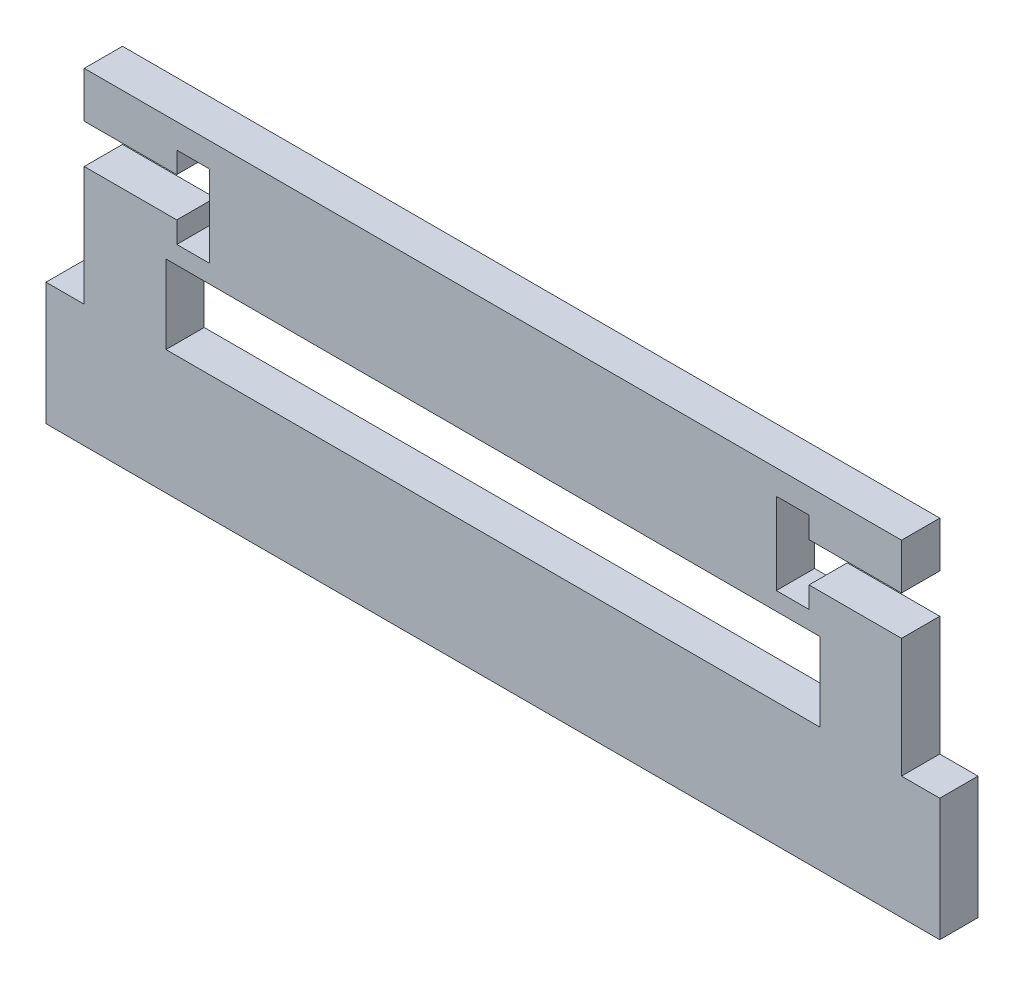
ISO-10303-21;
HEADER;
FILE_DESCRIPTION(('STEP AP214'),'2;1');
FILE_NAME('part.step','',(''),(''),'','','');
FILE_SCHEMA(('AUTOMOTIVE_DESIGN { 1 0 10303 214 1 1 1 1 }'));
ENDSEC;
DATA;
#1=APPLICATION_CONTEXT('core data for automotive mechanical design processes');
#2=APPLICATION_PROTOCOL_DEFINITION('international standard','automotive_design',2000,#1);
#3=PRODUCT_CONTEXT('',#1,'mechanical');
#4=PRODUCT('Part','Part','',(#3));
#5=PRODUCT_RELATED_PRODUCT_CATEGORY('part','',(#4));
#6=PRODUCT_DEFINITION_FORMATION('','',#4);
#7=PRODUCT_DEFINITION_CONTEXT('part definition',#1,'design');
#8=PRODUCT_DEFINITION('design','',#6,#7);
#9=PRODUCT_DEFINITION_SHAPE('','',#8);
#10=(LENGTH_UNIT() NAMED_UNIT(*) SI_UNIT(.MILLI.,.METRE.));
#11=(NAMED_UNIT(*) PLANE_ANGLE_UNIT() SI_UNIT($,.RADIAN.));
#12=(NAMED_UNIT(*) SI_UNIT($,.STERADIAN.) SOLID_ANGLE_UNIT());
#13=UNCERTAINTY_MEASURE_WITH_UNIT(LENGTH_MEASURE(1.E-05),#10,'distance_accuracy_value','');
#14=(GEOMETRIC_REPRESENTATION_CONTEXT(3) GLOBAL_UNCERTAINTY_ASSIGNED_CONTEXT((#13)) GLOBAL_UNIT_ASSIGNED_CONTEXT((#10,
#11,#12)) REPRESENTATION_CONTEXT('',''));
#15=CARTESIAN_POINT('',(0.,0.,0.));
#16=DIRECTION('',(0.,0.,1.));
#17=DIRECTION('',(1.,0.,0.));
#18=AXIS2_PLACEMENT_3D('',#15,#16,#17);
#19=CARTESIAN_POINT('',(31.75,0.,2.9718));
#20=DIRECTION('',(-1.,0.,0.));
#21=DIRECTION('',(0.,0.,1.));
#22=AXIS2_PLACEMENT_3D('',#19,#20,#21);
#23=PLANE('',#22);
#24=DIRECTION('',(0.,1.,0.));
#25=VECTOR('',#24,1.);
#26=CARTESIAN_POINT('',(31.75,0.,2.9718));
#27=LINE('',#26,#25);
#28=CARTESIAN_POINT('',(31.75,9.14399999999999,2.9718));
#29=VERTEX_POINT('',#28);
#30=CARTESIAN_POINT('',(31.75,12.7,2.9718));
#31=VERTEX_POINT('',#30);
#32=EDGE_CURVE('E419',#29,#31,#27,.T.);
#33=ORIENTED_EDGE('',*,*,#32,.F.);
#34=DIRECTION('',(0.,0.,-1.));
#35=VECTOR('',#34,1.);
#36=CARTESIAN_POINT('',(31.75,9.14399999999999,2.9718));
#37=LINE('',#36,#35);
#38=CARTESIAN_POINT('',(31.75,9.14399999999999,0.));
#39=VERTEX_POINT('',#38);
#40=EDGE_CURVE('E456',#29,#39,#37,.T.);
#41=ORIENTED_EDGE('',*,*,#40,.T.);
#42=DIRECTION('',(0.,1.,0.));
#43=VECTOR('',#42,1.);
#44=CARTESIAN_POINT('',(31.75,0.,0.));
#45=LINE('',#44,#43);
#46=CARTESIAN_POINT('',(31.75,12.7,0.));
#47=VERTEX_POINT('',#46);
#48=EDGE_CURVE('E579',#39,#47,#45,.T.);
#49=ORIENTED_EDGE('',*,*,#48,.T.);
#50=DIRECTION('',(0.,0.,-1.));
#51=VECTOR('',#50,1.);
#52=CARTESIAN_POINT('',(31.75,12.7,2.9718));
#53=LINE('',#52,#51);
#54=EDGE_CURVE('E612',#31,#47,#53,.T.);
#55=ORIENTED_EDGE('',*,*,#54,.F.);
#56=EDGE_LOOP('',(#33,#41,#49,#55));
#57=FACE_BOUND('',#56,.T.);
#58=ADVANCED_FACE('F48',(#57),#23,.F.);
#59=CARTESIAN_POINT('',(-31.75,0.,2.9718));
#60=DIRECTION('',(-1.,0.,0.));
#61=DIRECTION('',(0.,0.,1.));
#62=AXIS2_PLACEMENT_3D('',#59,#60,#61);
#63=PLANE('',#62);
#64=DIRECTION('',(0.,0.,-1.));
#65=VECTOR('',#64,1.);
#66=CARTESIAN_POINT('',(-31.75,9.144,2.9718));
#67=LINE('',#66,#65);
#68=CARTESIAN_POINT('',(-31.75,9.144,2.9718));
#69=VERTEX_POINT('',#68);
#70=CARTESIAN_POINT('',(-31.75,9.144,0.));
#71=VERTEX_POINT('',#70);
#72=EDGE_CURVE('E386',#69,#71,#67,.T.);
#73=ORIENTED_EDGE('',*,*,#72,.F.);
#74=DIRECTION('',(0.,1.,0.));
#75=VECTOR('',#74,1.);
#76=CARTESIAN_POINT('',(-31.75,0.,2.9718));
#77=LINE('',#76,#75);
#78=CARTESIAN_POINT('',(-31.75,12.7,2.9718));
#79=VERTEX_POINT('',#78);
#80=EDGE_CURVE('E672',#69,#79,#77,.T.);
#81=ORIENTED_EDGE('',*,*,#80,.T.);
#82=DIRECTION('',(0.,0.,-1.));
#83=VECTOR('',#82,1.);
#84=CARTESIAN_POINT('',(-31.75,12.7,2.9718));
#85=LINE('',#84,#83);
#86=CARTESIAN_POINT('',(-31.75,12.7,0.));
#87=VERTEX_POINT('',#86);
#88=EDGE_CURVE('E608',#79,#87,#85,.T.);
#89=ORIENTED_EDGE('',*,*,#88,.T.);
#90=DIRECTION('',(0.,1.,0.));
#91=VECTOR('',#90,1.);
#92=CARTESIAN_POINT('',(-31.75,0.,0.));
#93=LINE('',#92,#91);
#94=EDGE_CURVE('E588',#71,#87,#93,.T.);
#95=ORIENTED_EDGE('',*,*,#94,.F.);
#96=EDGE_LOOP('',(#73,#81,#89,#95));
#97=FACE_BOUND('',#96,.T.);
#98=ADVANCED_FACE('F695',(#97),#63,.T.);
#99=CARTESIAN_POINT('',(0.,-12.7,2.9718));
#100=DIRECTION('',(0.,1.,0.));
#101=DIRECTION('',(0.,0.,1.));
#102=AXIS2_PLACEMENT_3D('',#99,#100,#101);
#103=PLANE('',#102);
#104=DIRECTION('',(1.,0.,0.));
#105=VECTOR('',#104,1.);
#106=CARTESIAN_POINT('',(0.,-12.7,0.));
#107=LINE('',#106,#105);
#108=CARTESIAN_POINT('',(-34.7218,-12.7,0.));
#109=VERTEX_POINT('',#108);
#110=CARTESIAN_POINT('',(34.7218,-12.7,0.));
#111=VERTEX_POINT('',#110);
#112=EDGE_CURVE('E539',#109,#111,#107,.T.);
#113=ORIENTED_EDGE('',*,*,#112,.T.);
#114=DIRECTION('',(0.,0.,-1.));
#115=VECTOR('',#114,1.);
#116=CARTESIAN_POINT('',(34.7218,-12.7,2.9718));
#117=LINE('',#116,#115);
#118=CARTESIAN_POINT('',(34.7218,-12.7,2.9718));
#119=VERTEX_POINT('',#118);
#120=EDGE_CURVE('E12',#119,#111,#117,.T.);
#121=ORIENTED_EDGE('',*,*,#120,.F.);
#122=DIRECTION('',(1.,0.,0.));
#123=VECTOR('',#122,1.);
#124=CARTESIAN_POINT('',(0.,-12.7,2.9718));
#125=LINE('',#124,#123);
#126=CARTESIAN_POINT('',(-34.7218,-12.7,2.9718));
#127=VERTEX_POINT('',#126);
#128=EDGE_CURVE('E549',#127,#119,#125,.T.);
#129=ORIENTED_EDGE('',*,*,#128,.F.);
#130=DIRECTION('',(0.,0.,-1.));
#131=VECTOR('',#130,1.);
#132=CARTESIAN_POINT('',(-34.7218,-12.7,2.9718));
#133=LINE('',#132,#131);
#134=EDGE_CURVE('E565',#127,#109,#133,.T.);
#135=ORIENTED_EDGE('',*,*,#134,.T.);
#136=EDGE_LOOP('',(#113,#121,#129,#135));
#137=FACE_BOUND('',#136,.T.);
#138=ADVANCED_FACE('F50',(#137),#103,.F.);
#139=CARTESIAN_POINT('',(34.7218,0.,2.9718));
#140=DIRECTION('',(-1.,0.,0.));
#141=DIRECTION('',(0.,0.,1.));
#142=AXIS2_PLACEMENT_3D('',#139,#140,#141);
#143=PLANE('',#142);
#144=DIRECTION('',(0.,1.,0.));
#145=VECTOR('',#144,1.);
#146=CARTESIAN_POINT('',(34.7218,0.,0.));
#147=LINE('',#146,#145);
#148=CARTESIAN_POINT('',(34.7218,-3.175,0.));
#149=VERTEX_POINT('',#148);
#150=EDGE_CURVE('E571',#111,#149,#147,.T.);
#151=ORIENTED_EDGE('',*,*,#150,.T.);
#152=DIRECTION('',(0.,0.,-1.));
#153=VECTOR('',#152,1.);
#154=CARTESIAN_POINT('',(34.7218,-3.175,2.9718));
#155=LINE('',#154,#153);
#156=CARTESIAN_POINT('',(34.7218,-3.175,2.9718));
#157=VERTEX_POINT('',#156);
#158=EDGE_CURVE('E57',#157,#149,#155,.T.);
#159=ORIENTED_EDGE('',*,*,#158,.F.);
#160=DIRECTION('',(0.,1.,0.));
#161=VECTOR('',#160,1.);
#162=CARTESIAN_POINT('',(34.7218,0.,2.9718));
#163=LINE('',#162,#161);
#164=EDGE_CURVE('E553',#119,#157,#163,.T.);
#165=ORIENTED_EDGE('',*,*,#164,.F.);
#166=ORIENTED_EDGE('',*,*,#120,.T.);
#167=EDGE_LOOP('',(#151,#159,#165,#166));
#168=FACE_BOUND('',#167,.T.);
#169=ADVANCED_FACE('F626',(#168),#143,.F.);
#170=CARTESIAN_POINT('',(0.,-3.17500000000001,2.9718));
#171=DIRECTION('',(0.,1.,0.));
#172=DIRECTION('',(-1.,0.,0.));
#173=AXIS2_PLACEMENT_3D('',#170,#171,#172);
#174=PLANE('',#173);
#175=DIRECTION('',(1.,0.,0.));
#176=VECTOR('',#175,1.);
#177=CARTESIAN_POINT('',(0.,-3.17500000000001,0.));
#178=LINE('',#177,#176);
#179=CARTESIAN_POINT('',(31.75,-3.175,0.));
#180=VERTEX_POINT('',#179);
#181=EDGE_CURVE('E575',#180,#149,#178,.T.);
#182=ORIENTED_EDGE('',*,*,#181,.F.);
#183=DIRECTION('',(0.,0.,-1.));
#184=VECTOR('',#183,1.);
#185=CARTESIAN_POINT('',(31.75,-3.175,2.9718));
#186=LINE('',#185,#184);
#187=CARTESIAN_POINT('',(31.75,-3.175,2.9718));
#188=VERTEX_POINT('',#187);
#189=EDGE_CURVE('E616',#188,#180,#186,.T.);
#190=ORIENTED_EDGE('',*,*,#189,.F.);
#191=DIRECTION('',(1.,0.,0.));
#192=VECTOR('',#191,1.);
#193=CARTESIAN_POINT('',(0.,-3.17500000000001,2.9718));
#194=LINE('',#193,#192);
#195=EDGE_CURVE('E420',#188,#157,#194,.T.);
#196=ORIENTED_EDGE('',*,*,#195,.T.);
#197=ORIENTED_EDGE('',*,*,#158,.T.);
#198=EDGE_LOOP('',(#182,#190,#196,#197));
#199=FACE_BOUND('',#198,.T.);
#200=ADVANCED_FACE('F623',(#199),#174,.T.);
#201=CARTESIAN_POINT('',(31.75,6.09599999999999,0.));
#202=VERTEX_POINT('',#201);
#203=EDGE_CURVE('E580',#180,#202,#45,.T.);
#204=ORIENTED_EDGE('',*,*,#203,.T.);
#205=DIRECTION('',(0.,0.,-1.));
#206=VECTOR('',#205,1.);
#207=CARTESIAN_POINT('',(31.75,6.09599999999999,2.9718));
#208=LINE('',#207,#206);
#209=CARTESIAN_POINT('',(31.75,6.09599999999999,2.9718));
#210=VERTEX_POINT('',#209);
#211=EDGE_CURVE('E78',#210,#202,#208,.T.);
#212=ORIENTED_EDGE('',*,*,#211,.F.);
#213=EDGE_CURVE('E413',#188,#210,#27,.T.);
#214=ORIENTED_EDGE('',*,*,#213,.F.);
#215=ORIENTED_EDGE('',*,*,#189,.T.);
#216=EDGE_LOOP('',(#204,#212,#214,#215));
#217=FACE_BOUND('',#216,.T.);
#218=ADVANCED_FACE('F635',(#217),#23,.F.);
#219=CARTESIAN_POINT('',(0.,12.7,2.9718));
#220=DIRECTION('',(0.,1.,0.));
#221=DIRECTION('',(0.,0.,1.));
#222=AXIS2_PLACEMENT_3D('',#219,#220,#221);
#223=PLANE('',#222);
#224=DIRECTION('',(1.,0.,0.));
#225=VECTOR('',#224,1.);
#226=CARTESIAN_POINT('',(0.,12.7,0.));
#227=LINE('',#226,#225);
#228=EDGE_CURVE('E584',#87,#47,#227,.T.);
#229=ORIENTED_EDGE('',*,*,#228,.F.);
#230=ORIENTED_EDGE('',*,*,#88,.F.);
#231=DIRECTION('',(1.,0.,0.));
#232=VECTOR('',#231,1.);
#233=CARTESIAN_POINT('',(0.,12.7,2.9718));
#234=LINE('',#233,#232);
#235=EDGE_CURVE('E418',#79,#31,#234,.T.);
#236=ORIENTED_EDGE('',*,*,#235,.T.);
#237=ORIENTED_EDGE('',*,*,#54,.T.);
#238=EDGE_LOOP('',(#229,#230,#236,#237));
#239=FACE_BOUND('',#238,.T.);
#240=ADVANCED_FACE('F685',(#239),#223,.T.);
#241=DIRECTION('',(0.,0.,-1.));
#242=VECTOR('',#241,1.);
#243=CARTESIAN_POINT('',(-31.75,6.096,2.9718));
#244=LINE('',#243,#242);
#245=CARTESIAN_POINT('',(-31.75,6.096,2.9718));
#246=VERTEX_POINT('',#245);
#247=CARTESIAN_POINT('',(-31.75,6.096,0.));
#248=VERTEX_POINT('',#247);
#249=EDGE_CURVE('E389',#246,#248,#244,.T.);
#250=ORIENTED_EDGE('',*,*,#249,.T.);
#251=CARTESIAN_POINT('',(-31.75,-3.175,0.));
#252=VERTEX_POINT('',#251);
#253=EDGE_CURVE('E589',#252,#248,#93,.T.);
#254=ORIENTED_EDGE('',*,*,#253,.F.);
#255=DIRECTION('',(0.,0.,-1.));
#256=VECTOR('',#255,1.);
#257=CARTESIAN_POINT('',(-31.75,-3.175,2.9718));
#258=LINE('',#257,#256);
#259=CARTESIAN_POINT('',(-31.75,-3.175,2.9718));
#260=VERTEX_POINT('',#259);
#261=EDGE_CURVE('E605',#260,#252,#258,.T.);
#262=ORIENTED_EDGE('',*,*,#261,.F.);
#263=EDGE_CURVE('E669',#260,#246,#77,.T.);
#264=ORIENTED_EDGE('',*,*,#263,.T.);
#265=EDGE_LOOP('',(#250,#254,#262,#264));
#266=FACE_BOUND('',#265,.T.);
#267=ADVANCED_FACE('F667',(#266),#63,.T.);
#268=CARTESIAN_POINT('',(0.,-3.17500000000001,2.9718));
#269=DIRECTION('',(0.,-1.,0.));
#270=DIRECTION('',(1.,0.,0.));
#271=AXIS2_PLACEMENT_3D('',#268,#269,#270);
#272=PLANE('',#271);
#273=DIRECTION('',(-1.,0.,0.));
#274=VECTOR('',#273,1.);
#275=CARTESIAN_POINT('',(0.,-3.17500000000001,0.));
#276=LINE('',#275,#274);
#277=CARTESIAN_POINT('',(-34.7218,-3.175,0.));
#278=VERTEX_POINT('',#277);
#279=EDGE_CURVE('E593',#252,#278,#276,.T.);
#280=ORIENTED_EDGE('',*,*,#279,.T.);
#281=DIRECTION('',(0.,0.,-1.));
#282=VECTOR('',#281,1.);
#283=CARTESIAN_POINT('',(-34.7218,-3.175,2.9718));
#284=LINE('',#283,#282);
#285=CARTESIAN_POINT('',(-34.7218,-3.175,2.9718));
#286=VERTEX_POINT('',#285);
#287=EDGE_CURVE('E602',#286,#278,#284,.T.);
#288=ORIENTED_EDGE('',*,*,#287,.F.);
#289=DIRECTION('',(-1.,0.,0.));
#290=VECTOR('',#289,1.);
#291=CARTESIAN_POINT('',(0.,-3.17500000000001,2.9718));
#292=LINE('',#291,#290);
#293=EDGE_CURVE('E566',#260,#286,#292,.T.);
#294=ORIENTED_EDGE('',*,*,#293,.F.);
#295=ORIENTED_EDGE('',*,*,#261,.T.);
#296=EDGE_LOOP('',(#280,#288,#294,#295));
#297=FACE_BOUND('',#296,.T.);
#298=ADVANCED_FACE('F707',(#297),#272,.F.);
#299=CARTESIAN_POINT('',(-34.7218,0.,2.9718));
#300=DIRECTION('',(-1.,0.,0.));
#301=DIRECTION('',(0.,0.,1.));
#302=AXIS2_PLACEMENT_3D('',#299,#300,#301);
#303=PLANE('',#302);
#304=DIRECTION('',(0.,1.,0.));
#305=VECTOR('',#304,1.);
#306=CARTESIAN_POINT('',(-34.7218,0.,0.));
#307=LINE('',#306,#305);
#308=EDGE_CURVE('E554',#109,#278,#307,.T.);
#309=ORIENTED_EDGE('',*,*,#308,.F.);
#310=ORIENTED_EDGE('',*,*,#134,.F.);
#311=DIRECTION('',(0.,1.,0.));
#312=VECTOR('',#311,1.);
#313=CARTESIAN_POINT('',(-34.7218,0.,2.9718));
#314=LINE('',#313,#312);
#315=EDGE_CURVE('E560',#127,#286,#314,.T.);
#316=ORIENTED_EDGE('',*,*,#315,.T.);
#317=ORIENTED_EDGE('',*,*,#287,.T.);
#318=EDGE_LOOP('',(#309,#310,#316,#317));
#319=FACE_BOUND('',#318,.T.);
#320=ADVANCED_FACE('F712',(#319),#303,.T.);
#321=CARTESIAN_POINT('',(0.,0.,2.9718));
#322=DIRECTION('',(0.,0.,1.));
#323=DIRECTION('',(1.,0.,0.));
#324=AXIS2_PLACEMENT_3D('',#321,#322,#323);
#325=PLANE('',#324);
#326=DIRECTION('',(1.,0.,0.));
#327=VECTOR('',#326,1.);
#328=CARTESIAN_POINT('',(-31.75,9.144,2.9718));
#329=LINE('',#328,#327);
#330=CARTESIAN_POINT('',(-24.5618,9.144,2.9718));
#331=VERTEX_POINT('',#330);
#332=EDGE_CURVE('E338',#69,#331,#329,.T.);
#333=ORIENTED_EDGE('',*,*,#332,.T.);
#334=DIRECTION('',(0.,1.,0.));
#335=VECTOR('',#334,1.);
#336=CARTESIAN_POINT('',(-24.5618,10.795,2.9718));
#337=LINE('',#336,#335);
#338=CARTESIAN_POINT('',(-24.5618,10.795,2.9718));
#339=VERTEX_POINT('',#338);
#340=EDGE_CURVE('E342',#331,#339,#337,.T.);
#341=ORIENTED_EDGE('',*,*,#340,.T.);
#342=DIRECTION('',(1.,0.,0.));
#343=VECTOR('',#342,1.);
#344=CARTESIAN_POINT('',(-22.0218,10.795,2.9718));
#345=LINE('',#344,#343);
#346=CARTESIAN_POINT('',(-22.0218,10.795,2.9718));
#347=VERTEX_POINT('',#346);
#348=EDGE_CURVE('E347',#339,#347,#345,.T.);
#349=ORIENTED_EDGE('',*,*,#348,.T.);
#350=DIRECTION('',(0.,-1.,0.));
#351=VECTOR('',#350,1.);
#352=CARTESIAN_POINT('',(-22.0218,10.795,2.9718));
#353=LINE('',#352,#351);
#354=CARTESIAN_POINT('',(-22.0218,4.445,2.9718));
#355=VERTEX_POINT('',#354);
#356=EDGE_CURVE('E300',#347,#355,#353,.T.);
#357=ORIENTED_EDGE('',*,*,#356,.T.);
#358=DIRECTION('',(-1.,0.,0.));
#359=VECTOR('',#358,1.);
#360=CARTESIAN_POINT('',(-24.5618,4.445,2.9718));
#361=LINE('',#360,#359);
#362=CARTESIAN_POINT('',(-24.5618,4.445,2.9718));
#363=VERTEX_POINT('',#362);
#364=EDGE_CURVE('E293',#355,#363,#361,.T.);
#365=ORIENTED_EDGE('',*,*,#364,.T.);
#366=DIRECTION('',(0.,1.,0.));
#367=VECTOR('',#366,1.);
#368=CARTESIAN_POINT('',(-24.5618,6.096,2.9718));
#369=LINE('',#368,#367);
#370=CARTESIAN_POINT('',(-24.5618,6.096,2.9718));
#371=VERTEX_POINT('',#370);
#372=EDGE_CURVE('E303',#363,#371,#369,.T.);
#373=ORIENTED_EDGE('',*,*,#372,.T.);
#374=DIRECTION('',(-1.,0.,0.));
#375=VECTOR('',#374,1.);
#376=CARTESIAN_POINT('',(-31.75,6.096,2.9718));
#377=LINE('',#376,#375);
#378=EDGE_CURVE('E309',#371,#246,#377,.T.);
#379=ORIENTED_EDGE('',*,*,#378,.T.);
#380=ORIENTED_EDGE('',*,*,#263,.F.);
#381=ORIENTED_EDGE('',*,*,#293,.T.);
#382=ORIENTED_EDGE('',*,*,#315,.F.);
#383=ORIENTED_EDGE('',*,*,#128,.T.);
#384=ORIENTED_EDGE('',*,*,#164,.T.);
#385=ORIENTED_EDGE('',*,*,#195,.F.);
#386=ORIENTED_EDGE('',*,*,#213,.T.);
#387=DIRECTION('',(-1.,0.,0.));
#388=VECTOR('',#387,1.);
#389=CARTESIAN_POINT('',(31.75,6.09599999999999,2.9718));
#390=LINE('',#389,#388);
#391=CARTESIAN_POINT('',(24.5618,6.09599999999999,2.9718));
#392=VERTEX_POINT('',#391);
#393=EDGE_CURVE('E400',#210,#392,#390,.T.);
#394=ORIENTED_EDGE('',*,*,#393,.T.);
#395=DIRECTION('',(0.,-1.,0.));
#396=VECTOR('',#395,1.);
#397=CARTESIAN_POINT('',(24.5618,6.09599999999999,2.9718));
#398=LINE('',#397,#396);
#399=CARTESIAN_POINT('',(24.5618,4.445,2.9718));
#400=VERTEX_POINT('',#399);
#401=EDGE_CURVE('E433',#392,#400,#398,.T.);
#402=ORIENTED_EDGE('',*,*,#401,.T.);
#403=DIRECTION('',(-1.,0.,0.));
#404=VECTOR('',#403,1.);
#405=CARTESIAN_POINT('',(24.5618,4.445,2.9718));
#406=LINE('',#405,#404);
#407=CARTESIAN_POINT('',(22.0218,4.445,2.9718));
#408=VERTEX_POINT('',#407);
#409=EDGE_CURVE('E437',#400,#408,#406,.T.);
#410=ORIENTED_EDGE('',*,*,#409,.T.);
#411=DIRECTION('',(0.,1.,0.));
#412=VECTOR('',#411,1.);
#413=CARTESIAN_POINT('',(22.0218,10.795,2.9718));
#414=LINE('',#413,#412);
#415=CARTESIAN_POINT('',(22.0218,10.795,2.9718));
#416=VERTEX_POINT('',#415);
#417=EDGE_CURVE('E442',#408,#416,#414,.T.);
#418=ORIENTED_EDGE('',*,*,#417,.T.);
#419=DIRECTION('',(1.,0.,0.));
#420=VECTOR('',#419,1.);
#421=CARTESIAN_POINT('',(22.0218,10.795,2.9718));
#422=LINE('',#421,#420);
#423=CARTESIAN_POINT('',(24.5618,10.795,2.9718));
#424=VERTEX_POINT('',#423);
#425=EDGE_CURVE('E447',#416,#424,#422,.T.);
#426=ORIENTED_EDGE('',*,*,#425,.T.);
#427=DIRECTION('',(0.,-1.,0.));
#428=VECTOR('',#427,1.);
#429=CARTESIAN_POINT('',(24.5618,10.795,2.9718));
#430=LINE('',#429,#428);
#431=CARTESIAN_POINT('',(24.5618,9.14399999999999,2.9718));
#432=VERTEX_POINT('',#431);
#433=EDGE_CURVE('E451',#424,#432,#430,.T.);
#434=ORIENTED_EDGE('',*,*,#433,.T.);
#435=DIRECTION('',(1.,0.,0.));
#436=VECTOR('',#435,1.);
#437=CARTESIAN_POINT('',(31.75,9.14399999999999,2.9718));
#438=LINE('',#437,#436);
#439=EDGE_CURVE('E395',#432,#29,#438,.T.);
#440=ORIENTED_EDGE('',*,*,#439,.T.);
#441=ORIENTED_EDGE('',*,*,#32,.T.);
#442=ORIENTED_EDGE('',*,*,#235,.F.);
#443=ORIENTED_EDGE('',*,*,#80,.F.);
#444=EDGE_LOOP('',(#333,#341,#349,#357,#365,#373,#379,#380,#381,#382,#383,#384,#385,#386,#394,
#402,#410,#418,#426,#434,#440,#441,#442,#443));
#445=FACE_BOUND('',#444,.T.);
#446=DIRECTION('',(0.,-1.,0.));
#447=VECTOR('',#446,1.);
#448=CARTESIAN_POINT('',(-25.4,-3.048,2.9718));
#449=LINE('',#448,#447);
#450=CARTESIAN_POINT('',(-25.4,3.048,2.9718));
#451=VERTEX_POINT('',#450);
#452=CARTESIAN_POINT('',(-25.4,-3.048,2.9718));
#453=VERTEX_POINT('',#452);
#454=EDGE_CURVE('E376',#451,#453,#449,.T.);
#455=ORIENTED_EDGE('',*,*,#454,.F.);
#456=DIRECTION('',(-1.,0.,0.));
#457=VECTOR('',#456,1.);
#458=CARTESIAN_POINT('',(-25.4,3.048,2.9718));
#459=LINE('',#458,#457);
#460=CARTESIAN_POINT('',(25.4,3.048,2.9718));
#461=VERTEX_POINT('',#460);
#462=EDGE_CURVE('E509',#461,#451,#459,.T.);
#463=ORIENTED_EDGE('',*,*,#462,.F.);
#464=DIRECTION('',(0.,1.,0.));
#465=VECTOR('',#464,1.);
#466=CARTESIAN_POINT('',(25.4,-3.048,2.9718));
#467=LINE('',#466,#465);
#468=CARTESIAN_POINT('',(25.4,-3.048,2.9718));
#469=VERTEX_POINT('',#468);
#470=EDGE_CURVE('E534',#469,#461,#467,.T.);
#471=ORIENTED_EDGE('',*,*,#470,.F.);
#472=DIRECTION('',(1.,0.,0.));
#473=VECTOR('',#472,1.);
#474=CARTESIAN_POINT('',(-25.4,-3.048,2.9718));
#475=LINE('',#474,#473);
#476=EDGE_CURVE('E524',#453,#469,#475,.T.);
#477=ORIENTED_EDGE('',*,*,#476,.F.);
#478=EDGE_LOOP('',(#455,#463,#471,#477));
#479=FACE_BOUND('',#478,.T.);
#480=ADVANCED_FACE('F312',(#445,#479),#325,.T.);
#481=CARTESIAN_POINT('',(0.,0.,0.));
#482=DIRECTION('',(0.,0.,1.));
#483=DIRECTION('',(1.,0.,0.));
#484=AXIS2_PLACEMENT_3D('',#481,#482,#483);
#485=PLANE('',#484);
#486=DIRECTION('',(-1.,0.,0.));
#487=VECTOR('',#486,1.);
#488=CARTESIAN_POINT('',(-25.4,3.048,0.));
#489=LINE('',#488,#487);
#490=CARTESIAN_POINT('',(25.4,3.048,0.));
#491=VERTEX_POINT('',#490);
#492=CARTESIAN_POINT('',(-25.4,3.048,0.));
#493=VERTEX_POINT('',#492);
#494=EDGE_CURVE('E517',#491,#493,#489,.T.);
#495=ORIENTED_EDGE('',*,*,#494,.T.);
#496=DIRECTION('',(0.,-1.,0.));
#497=VECTOR('',#496,1.);
#498=CARTESIAN_POINT('',(-25.4,-3.048,0.));
#499=LINE('',#498,#497);
#500=CARTESIAN_POINT('',(-25.4,-3.048,0.));
#501=VERTEX_POINT('',#500);
#502=EDGE_CURVE('E504',#493,#501,#499,.T.);
#503=ORIENTED_EDGE('',*,*,#502,.T.);
#504=DIRECTION('',(1.,0.,0.));
#505=VECTOR('',#504,1.);
#506=CARTESIAN_POINT('',(-25.4,-3.048,0.));
#507=LINE('',#506,#505);
#508=CARTESIAN_POINT('',(25.4,-3.048,0.));
#509=VERTEX_POINT('',#508);
#510=EDGE_CURVE('E508',#501,#509,#507,.T.);
#511=ORIENTED_EDGE('',*,*,#510,.T.);
#512=DIRECTION('',(0.,1.,0.));
#513=VECTOR('',#512,1.);
#514=CARTESIAN_POINT('',(25.4,-3.048,0.));
#515=LINE('',#514,#513);
#516=EDGE_CURVE('E513',#509,#491,#515,.T.);
#517=ORIENTED_EDGE('',*,*,#516,.T.);
#518=EDGE_LOOP('',(#495,#503,#511,#517));
#519=FACE_BOUND('',#518,.T.);
#520=DIRECTION('',(0.,1.,0.));
#521=VECTOR('',#520,1.);
#522=CARTESIAN_POINT('',(-24.5618,10.795,0.));
#523=LINE('',#522,#521);
#524=CARTESIAN_POINT('',(-24.5618,9.144,0.));
#525=VERTEX_POINT('',#524);
#526=CARTESIAN_POINT('',(-24.5618,10.795,0.));
#527=VERTEX_POINT('',#526);
#528=EDGE_CURVE('E366',#525,#527,#523,.T.);
#529=ORIENTED_EDGE('',*,*,#528,.F.);
#530=DIRECTION('',(1.,0.,0.));
#531=VECTOR('',#530,1.);
#532=CARTESIAN_POINT('',(-31.75,9.144,0.));
#533=LINE('',#532,#531);
#534=EDGE_CURVE('E362',#71,#525,#533,.T.);
#535=ORIENTED_EDGE('',*,*,#534,.F.);
#536=ORIENTED_EDGE('',*,*,#94,.T.);
#537=ORIENTED_EDGE('',*,*,#228,.T.);
#538=ORIENTED_EDGE('',*,*,#48,.F.);
#539=DIRECTION('',(1.,0.,0.));
#540=VECTOR('',#539,1.);
#541=CARTESIAN_POINT('',(31.75,9.14399999999999,0.));
#542=LINE('',#541,#540);
#543=CARTESIAN_POINT('',(24.5618,9.14399999999999,0.));
#544=VERTEX_POINT('',#543);
#545=EDGE_CURVE('E457',#544,#39,#542,.T.);
#546=ORIENTED_EDGE('',*,*,#545,.F.);
#547=DIRECTION('',(0.,-1.,0.));
#548=VECTOR('',#547,1.);
#549=CARTESIAN_POINT('',(24.5618,10.795,0.));
#550=LINE('',#549,#548);
#551=CARTESIAN_POINT('',(24.5618,10.795,0.));
#552=VERTEX_POINT('',#551);
#553=EDGE_CURVE('E401',#552,#544,#550,.T.);
#554=ORIENTED_EDGE('',*,*,#553,.F.);
#555=DIRECTION('',(1.,0.,0.));
#556=VECTOR('',#555,1.);
#557=CARTESIAN_POINT('',(22.0218,10.795,0.));
#558=LINE('',#557,#556);
#559=CARTESIAN_POINT('',(22.0218,10.795,0.));
#560=VERTEX_POINT('',#559);
#561=EDGE_CURVE('E475',#560,#552,#558,.T.);
#562=ORIENTED_EDGE('',*,*,#561,.F.);
#563=DIRECTION('',(0.,1.,0.));
#564=VECTOR('',#563,1.);
#565=CARTESIAN_POINT('',(22.0218,10.795,0.));
#566=LINE('',#565,#564);
#567=CARTESIAN_POINT('',(22.0218,4.445,0.));
#568=VERTEX_POINT('',#567);
#569=EDGE_CURVE('E471',#568,#560,#566,.T.);
#570=ORIENTED_EDGE('',*,*,#569,.F.);
#571=DIRECTION('',(-1.,0.,0.));
#572=VECTOR('',#571,1.);
#573=CARTESIAN_POINT('',(24.5618,4.445,0.));
#574=LINE('',#573,#572);
#575=CARTESIAN_POINT('',(24.5618,4.445,0.));
#576=VERTEX_POINT('',#575);
#577=EDGE_CURVE('E467',#576,#568,#574,.T.);
#578=ORIENTED_EDGE('',*,*,#577,.F.);
#579=DIRECTION('',(0.,-1.,0.));
#580=VECTOR('',#579,1.);
#581=CARTESIAN_POINT('',(24.5618,6.09599999999999,0.));
#582=LINE('',#581,#580);
#583=CARTESIAN_POINT('',(24.5618,6.09599999999999,0.));
#584=VERTEX_POINT('',#583);
#585=EDGE_CURVE('E463',#584,#576,#582,.T.);
#586=ORIENTED_EDGE('',*,*,#585,.F.);
#587=DIRECTION('',(-1.,0.,0.));
#588=VECTOR('',#587,1.);
#589=CARTESIAN_POINT('',(31.75,6.09599999999999,0.));
#590=LINE('',#589,#588);
#591=EDGE_CURVE('E460',#202,#584,#590,.T.);
#592=ORIENTED_EDGE('',*,*,#591,.F.);
#593=ORIENTED_EDGE('',*,*,#203,.F.);
#594=ORIENTED_EDGE('',*,*,#181,.T.);
#595=ORIENTED_EDGE('',*,*,#150,.F.);
#596=ORIENTED_EDGE('',*,*,#112,.F.);
#597=ORIENTED_EDGE('',*,*,#308,.T.);
#598=ORIENTED_EDGE('',*,*,#279,.F.);
#599=ORIENTED_EDGE('',*,*,#253,.T.);
#600=DIRECTION('',(-1.,0.,0.));
#601=VECTOR('',#600,1.);
#602=CARTESIAN_POINT('',(-31.75,6.096,0.));
#603=LINE('',#602,#601);
#604=CARTESIAN_POINT('',(-24.5618,6.096,0.));
#605=VERTEX_POINT('',#604);
#606=EDGE_CURVE('E359',#605,#248,#603,.T.);
#607=ORIENTED_EDGE('',*,*,#606,.F.);
#608=DIRECTION('',(0.,1.,0.));
#609=VECTOR('',#608,1.);
#610=CARTESIAN_POINT('',(-24.5618,6.096,0.));
#611=LINE('',#610,#609);
#612=CARTESIAN_POINT('',(-24.5618,4.445,0.));
#613=VERTEX_POINT('',#612);
#614=EDGE_CURVE('E355',#613,#605,#611,.T.);
#615=ORIENTED_EDGE('',*,*,#614,.F.);
#616=DIRECTION('',(-1.,0.,0.));
#617=VECTOR('',#616,1.);
#618=CARTESIAN_POINT('',(-24.5618,4.445,0.));
#619=LINE('',#618,#617);
#620=CARTESIAN_POINT('',(-22.0218,4.445,0.));
#621=VERTEX_POINT('',#620);
#622=EDGE_CURVE('E67',#621,#613,#619,.T.);
#623=ORIENTED_EDGE('',*,*,#622,.F.);
#624=DIRECTION('',(0.,-1.,0.));
#625=VECTOR('',#624,1.);
#626=CARTESIAN_POINT('',(-22.0218,10.795,0.));
#627=LINE('',#626,#625);
#628=CARTESIAN_POINT('',(-22.0218,10.795,0.));
#629=VERTEX_POINT('',#628);
#630=EDGE_CURVE('E317',#629,#621,#627,.T.);
#631=ORIENTED_EDGE('',*,*,#630,.F.);
#632=DIRECTION('',(1.,0.,0.));
#633=VECTOR('',#632,1.);
#634=CARTESIAN_POINT('',(-22.0218,10.795,0.));
#635=LINE('',#634,#633);
#636=EDGE_CURVE('E321',#527,#629,#635,.T.);
#637=ORIENTED_EDGE('',*,*,#636,.F.);
#638=EDGE_LOOP('',(#529,#535,#536,#537,#538,#546,#554,#562,#570,#578,#586,#592,#593,#594,#595,
#596,#597,#598,#599,#607,#615,#623,#631,#637));
#639=FACE_BOUND('',#638,.T.);
#640=ADVANCED_FACE('F632',(#519,#639),#485,.F.);
#641=CARTESIAN_POINT('',(-25.4,-3.048,0.));
#642=DIRECTION('',(-1.,0.,0.));
#643=DIRECTION('',(0.,0.,1.));
#644=AXIS2_PLACEMENT_3D('',#641,#642,#643);
#645=PLANE('',#644);
#646=ORIENTED_EDGE('',*,*,#454,.T.);
#647=DIRECTION('',(0.,0.,1.));
#648=VECTOR('',#647,1.);
#649=CARTESIAN_POINT('',(-25.4,-3.048,0.));
#650=LINE('',#649,#648);
#651=EDGE_CURVE('E521',#501,#453,#650,.T.);
#652=ORIENTED_EDGE('',*,*,#651,.F.);
#653=ORIENTED_EDGE('',*,*,#502,.F.);
#654=DIRECTION('',(0.,0.,1.));
#655=VECTOR('',#654,1.);
#656=CARTESIAN_POINT('',(-25.4,3.048,0.));
#657=LINE('',#656,#655);
#658=EDGE_CURVE('E536',#493,#451,#657,.T.);
#659=ORIENTED_EDGE('',*,*,#658,.T.);
#660=EDGE_LOOP('',(#646,#652,#653,#659));
#661=FACE_BOUND('',#660,.T.);
#662=ADVANCED_FACE('F760',(#661),#645,.F.);
#663=CARTESIAN_POINT('',(-25.4,3.048,0.));
#664=DIRECTION('',(0.,1.,0.));
#665=DIRECTION('',(0.,0.,1.));
#666=AXIS2_PLACEMENT_3D('',#663,#664,#665);
#667=PLANE('',#666);
#668=ORIENTED_EDGE('',*,*,#462,.T.);
#669=ORIENTED_EDGE('',*,*,#658,.F.);
#670=ORIENTED_EDGE('',*,*,#494,.F.);
#671=DIRECTION('',(0.,0.,1.));
#672=VECTOR('',#671,1.);
#673=CARTESIAN_POINT('',(25.4,3.048,0.));
#674=LINE('',#673,#672);
#675=EDGE_CURVE('E540',#491,#461,#674,.T.);
#676=ORIENTED_EDGE('',*,*,#675,.T.);
#677=EDGE_LOOP('',(#668,#669,#670,#676));
#678=FACE_BOUND('',#677,.T.);
#679=ADVANCED_FACE('F756',(#678),#667,.F.);
#680=CARTESIAN_POINT('',(25.4,-3.048,0.));
#681=DIRECTION('',(1.,0.,0.));
#682=DIRECTION('',(0.,0.,-1.));
#683=AXIS2_PLACEMENT_3D('',#680,#681,#682);
#684=PLANE('',#683);
#685=ORIENTED_EDGE('',*,*,#470,.T.);
#686=ORIENTED_EDGE('',*,*,#675,.F.);
#687=ORIENTED_EDGE('',*,*,#516,.F.);
#688=DIRECTION('',(0.,0.,1.));
#689=VECTOR('',#688,1.);
#690=CARTESIAN_POINT('',(25.4,-3.048,0.));
#691=LINE('',#690,#689);
#692=EDGE_CURVE('E543',#509,#469,#691,.T.);
#693=ORIENTED_EDGE('',*,*,#692,.T.);
#694=EDGE_LOOP('',(#685,#686,#687,#693));
#695=FACE_BOUND('',#694,.T.);
#696=ADVANCED_FACE('F741',(#695),#684,.F.);
#697=CARTESIAN_POINT('',(-25.4,-3.048,0.));
#698=DIRECTION('',(0.,-1.,0.));
#699=DIRECTION('',(0.,0.,-1.));
#700=AXIS2_PLACEMENT_3D('',#697,#698,#699);
#701=PLANE('',#700);
#702=ORIENTED_EDGE('',*,*,#476,.T.);
#703=ORIENTED_EDGE('',*,*,#692,.F.);
#704=ORIENTED_EDGE('',*,*,#510,.F.);
#705=ORIENTED_EDGE('',*,*,#651,.T.);
#706=EDGE_LOOP('',(#702,#703,#704,#705));
#707=FACE_BOUND('',#706,.T.);
#708=ADVANCED_FACE('F782',(#707),#701,.F.);
#709=CARTESIAN_POINT('',(31.75,9.14399999999999,2.9718));
#710=DIRECTION('',(0.,1.,0.));
#711=DIRECTION('',(0.,0.,1.));
#712=AXIS2_PLACEMENT_3D('',#709,#710,#711);
#713=PLANE('',#712);
#714=ORIENTED_EDGE('',*,*,#545,.T.);
#715=ORIENTED_EDGE('',*,*,#40,.F.);
#716=ORIENTED_EDGE('',*,*,#439,.F.);
#717=DIRECTION('',(0.,0.,-1.));
#718=VECTOR('',#717,1.);
#719=CARTESIAN_POINT('',(24.5618,9.14399999999999,2.9718));
#720=LINE('',#719,#718);
#721=EDGE_CURVE('E356',#432,#544,#720,.T.);
#722=ORIENTED_EDGE('',*,*,#721,.T.);
#723=EDGE_LOOP('',(#714,#715,#716,#722));
#724=FACE_BOUND('',#723,.T.);
#725=ADVANCED_FACE('F785',(#724),#713,.F.);
#726=CARTESIAN_POINT('',(24.5618,10.795,2.9718));
#727=DIRECTION('',(1.,0.,0.));
#728=DIRECTION('',(0.,0.,-1.));
#729=AXIS2_PLACEMENT_3D('',#726,#727,#728);
#730=PLANE('',#729);
#731=ORIENTED_EDGE('',*,*,#553,.T.);
#732=ORIENTED_EDGE('',*,*,#721,.F.);
#733=ORIENTED_EDGE('',*,*,#433,.F.);
#734=DIRECTION('',(0.,0.,-1.));
#735=VECTOR('',#734,1.);
#736=CARTESIAN_POINT('',(24.5618,10.795,2.9718));
#737=LINE('',#736,#735);
#738=EDGE_CURVE('E484',#424,#552,#737,.T.);
#739=ORIENTED_EDGE('',*,*,#738,.T.);
#740=EDGE_LOOP('',(#731,#732,#733,#739));
#741=FACE_BOUND('',#740,.T.);
#742=ADVANCED_FACE('F890',(#741),#730,.F.);
#743=CARTESIAN_POINT('',(22.0218,10.795,2.9718));
#744=DIRECTION('',(0.,1.,0.));
#745=DIRECTION('',(0.,0.,1.));
#746=AXIS2_PLACEMENT_3D('',#743,#744,#745);
#747=PLANE('',#746);
#748=ORIENTED_EDGE('',*,*,#561,.T.);
#749=ORIENTED_EDGE('',*,*,#738,.F.);
#750=ORIENTED_EDGE('',*,*,#425,.F.);
#751=DIRECTION('',(0.,0.,-1.));
#752=VECTOR('',#751,1.);
#753=CARTESIAN_POINT('',(22.0218,10.795,2.9718));
#754=LINE('',#753,#752);
#755=EDGE_CURVE('E487',#416,#560,#754,.T.);
#756=ORIENTED_EDGE('',*,*,#755,.T.);
#757=EDGE_LOOP('',(#748,#749,#750,#756));
#758=FACE_BOUND('',#757,.T.);
#759=ADVANCED_FACE('F881',(#758),#747,.F.);
#760=CARTESIAN_POINT('',(22.0218,10.795,2.9718));
#761=DIRECTION('',(-1.,0.,0.));
#762=DIRECTION('',(0.,-1.,0.));
#763=AXIS2_PLACEMENT_3D('',#760,#761,#762);
#764=PLANE('',#763);
#765=ORIENTED_EDGE('',*,*,#569,.T.);
#766=ORIENTED_EDGE('',*,*,#755,.F.);
#767=ORIENTED_EDGE('',*,*,#417,.F.);
#768=DIRECTION('',(0.,0.,-1.));
#769=VECTOR('',#768,1.);
#770=CARTESIAN_POINT('',(22.0218,4.445,2.9718));
#771=LINE('',#770,#769);
#772=EDGE_CURVE('E490',#408,#568,#771,.T.);
#773=ORIENTED_EDGE('',*,*,#772,.T.);
#774=EDGE_LOOP('',(#765,#766,#767,#773));
#775=FACE_BOUND('',#774,.T.);
#776=ADVANCED_FACE('F772',(#775),#764,.F.);
#777=CARTESIAN_POINT('',(24.5618,4.445,2.9718));
#778=DIRECTION('',(0.,-1.,0.));
#779=DIRECTION('',(0.,0.,-1.));
#780=AXIS2_PLACEMENT_3D('',#777,#778,#779);
#781=PLANE('',#780);
#782=ORIENTED_EDGE('',*,*,#577,.T.);
#783=ORIENTED_EDGE('',*,*,#772,.F.);
#784=ORIENTED_EDGE('',*,*,#409,.F.);
#785=DIRECTION('',(0.,0.,-1.));
#786=VECTOR('',#785,1.);
#787=CARTESIAN_POINT('',(24.5618,4.445,2.9718));
#788=LINE('',#787,#786);
#789=EDGE_CURVE('E493',#400,#576,#788,.T.);
#790=ORIENTED_EDGE('',*,*,#789,.T.);
#791=EDGE_LOOP('',(#782,#783,#784,#790));
#792=FACE_BOUND('',#791,.T.);
#793=ADVANCED_FACE('F767',(#792),#781,.F.);
#794=CARTESIAN_POINT('',(24.5618,6.09599999999999,2.9718));
#795=DIRECTION('',(1.,0.,0.));
#796=DIRECTION('',(0.,0.,-1.));
#797=AXIS2_PLACEMENT_3D('',#794,#795,#796);
#798=PLANE('',#797);
#799=ORIENTED_EDGE('',*,*,#585,.T.);
#800=ORIENTED_EDGE('',*,*,#789,.F.);
#801=ORIENTED_EDGE('',*,*,#401,.F.);
#802=DIRECTION('',(0.,0.,-1.));
#803=VECTOR('',#802,1.);
#804=CARTESIAN_POINT('',(24.5618,6.09599999999999,2.9718));
#805=LINE('',#804,#803);
#806=EDGE_CURVE('E496',#392,#584,#805,.T.);
#807=ORIENTED_EDGE('',*,*,#806,.T.);
#808=EDGE_LOOP('',(#799,#800,#801,#807));
#809=FACE_BOUND('',#808,.T.);
#810=ADVANCED_FACE('F771',(#809),#798,.F.);
#811=CARTESIAN_POINT('',(31.75,6.09599999999999,2.9718));
#812=DIRECTION('',(0.,-1.,0.));
#813=DIRECTION('',(1.,0.,0.));
#814=AXIS2_PLACEMENT_3D('',#811,#812,#813);
#815=PLANE('',#814);
#816=ORIENTED_EDGE('',*,*,#591,.T.);
#817=ORIENTED_EDGE('',*,*,#806,.F.);
#818=ORIENTED_EDGE('',*,*,#393,.F.);
#819=ORIENTED_EDGE('',*,*,#211,.T.);
#820=EDGE_LOOP('',(#816,#817,#818,#819));
#821=FACE_BOUND('',#820,.T.);
#822=ADVANCED_FACE('F860',(#821),#815,.F.);
#823=CARTESIAN_POINT('',(-24.5618,4.445,2.9718));
#824=DIRECTION('',(0.,-1.,0.));
#825=DIRECTION('',(0.,0.,-1.));
#826=AXIS2_PLACEMENT_3D('',#823,#824,#825);
#827=PLANE('',#826);
#828=ORIENTED_EDGE('',*,*,#622,.T.);
#829=DIRECTION('',(0.,0.,-1.));
#830=VECTOR('',#829,1.);
#831=CARTESIAN_POINT('',(-24.5618,4.445,2.9718));
#832=LINE('',#831,#830);
#833=EDGE_CURVE('E289',#363,#613,#832,.T.);
#834=ORIENTED_EDGE('',*,*,#833,.F.);
#835=ORIENTED_EDGE('',*,*,#364,.F.);
#836=DIRECTION('',(0.,0.,-1.));
#837=VECTOR('',#836,1.);
#838=CARTESIAN_POINT('',(-22.0218,4.445,2.9718));
#839=LINE('',#838,#837);
#840=EDGE_CURVE('E373',#355,#621,#839,.T.);
#841=ORIENTED_EDGE('',*,*,#840,.T.);
#842=EDGE_LOOP('',(#828,#834,#835,#841));
#843=FACE_BOUND('',#842,.T.);
#844=ADVANCED_FACE('F291',(#843),#827,.F.);
#845=CARTESIAN_POINT('',(-22.0218,10.795,2.9718));
#846=DIRECTION('',(1.,0.,0.));
#847=DIRECTION('',(0.,1.,0.));
#848=AXIS2_PLACEMENT_3D('',#845,#846,#847);
#849=PLANE('',#848);
#850=ORIENTED_EDGE('',*,*,#630,.T.);
#851=ORIENTED_EDGE('',*,*,#840,.F.);
#852=ORIENTED_EDGE('',*,*,#356,.F.);
#853=DIRECTION('',(0.,0.,-1.));
#854=VECTOR('',#853,1.);
#855=CARTESIAN_POINT('',(-22.0218,10.795,2.9718));
#856=LINE('',#855,#854);
#857=EDGE_CURVE('E377',#347,#629,#856,.T.);
#858=ORIENTED_EDGE('',*,*,#857,.T.);
#859=EDGE_LOOP('',(#850,#851,#852,#858));
#860=FACE_BOUND('',#859,.T.);
#861=ADVANCED_FACE('F659',(#860),#849,.F.);
#862=CARTESIAN_POINT('',(-22.0218,10.795,2.9718));
#863=DIRECTION('',(0.,1.,0.));
#864=DIRECTION('',(0.,0.,1.));
#865=AXIS2_PLACEMENT_3D('',#862,#863,#864);
#866=PLANE('',#865);
#867=ORIENTED_EDGE('',*,*,#636,.T.);
#868=ORIENTED_EDGE('',*,*,#857,.F.);
#869=ORIENTED_EDGE('',*,*,#348,.F.);
#870=DIRECTION('',(0.,0.,-1.));
#871=VECTOR('',#870,1.);
#872=CARTESIAN_POINT('',(-24.5618,10.795,2.9718));
#873=LINE('',#872,#871);
#874=EDGE_CURVE('E380',#339,#527,#873,.T.);
#875=ORIENTED_EDGE('',*,*,#874,.T.);
#876=EDGE_LOOP('',(#867,#868,#869,#875));
#877=FACE_BOUND('',#876,.T.);
#878=ADVANCED_FACE('F656',(#877),#866,.F.);
#879=CARTESIAN_POINT('',(-24.5618,10.795,2.9718));
#880=DIRECTION('',(-1.,0.,0.));
#881=DIRECTION('',(0.,0.,1.));
#882=AXIS2_PLACEMENT_3D('',#879,#880,#881);
#883=PLANE('',#882);
#884=ORIENTED_EDGE('',*,*,#528,.T.);
#885=ORIENTED_EDGE('',*,*,#874,.F.);
#886=ORIENTED_EDGE('',*,*,#340,.F.);
#887=DIRECTION('',(0.,0.,-1.));
#888=VECTOR('',#887,1.);
#889=CARTESIAN_POINT('',(-24.5618,9.144,2.9718));
#890=LINE('',#889,#888);
#891=EDGE_CURVE('E383',#331,#525,#890,.T.);
#892=ORIENTED_EDGE('',*,*,#891,.T.);
#893=EDGE_LOOP('',(#884,#885,#886,#892));
#894=FACE_BOUND('',#893,.T.);
#895=ADVANCED_FACE('F653',(#894),#883,.F.);
#896=CARTESIAN_POINT('',(-31.75,9.144,2.9718));
#897=DIRECTION('',(0.,1.,0.));
#898=DIRECTION('',(0.,0.,1.));
#899=AXIS2_PLACEMENT_3D('',#896,#897,#898);
#900=PLANE('',#899);
#901=ORIENTED_EDGE('',*,*,#534,.T.);
#902=ORIENTED_EDGE('',*,*,#891,.F.);
#903=ORIENTED_EDGE('',*,*,#332,.F.);
#904=ORIENTED_EDGE('',*,*,#72,.T.);
#905=EDGE_LOOP('',(#901,#902,#903,#904));
#906=FACE_BOUND('',#905,.T.);
#907=ADVANCED_FACE('F796',(#906),#900,.F.);
#908=CARTESIAN_POINT('',(-31.75,6.096,2.9718));
#909=DIRECTION('',(0.,-1.,0.));
#910=DIRECTION('',(1.,0.,0.));
#911=AXIS2_PLACEMENT_3D('',#908,#909,#910);
#912=PLANE('',#911);
#913=ORIENTED_EDGE('',*,*,#606,.T.);
#914=ORIENTED_EDGE('',*,*,#249,.F.);
#915=ORIENTED_EDGE('',*,*,#378,.F.);
#916=DIRECTION('',(0.,0.,-1.));
#917=VECTOR('',#916,1.);
#918=CARTESIAN_POINT('',(-24.5618,6.096,2.9718));
#919=LINE('',#918,#917);
#920=EDGE_CURVE('E299',#371,#605,#919,.T.);
#921=ORIENTED_EDGE('',*,*,#920,.T.);
#922=EDGE_LOOP('',(#913,#914,#915,#921));
#923=FACE_BOUND('',#922,.T.);
#924=ADVANCED_FACE('F664',(#923),#912,.F.);
#925=CARTESIAN_POINT('',(-24.5618,6.096,2.9718));
#926=DIRECTION('',(-1.,0.,0.));
#927=DIRECTION('',(0.,0.,1.));
#928=AXIS2_PLACEMENT_3D('',#925,#926,#927);
#929=PLANE('',#928);
#930=ORIENTED_EDGE('',*,*,#614,.T.);
#931=ORIENTED_EDGE('',*,*,#920,.F.);
#932=ORIENTED_EDGE('',*,*,#372,.F.);
#933=ORIENTED_EDGE('',*,*,#833,.T.);
#934=EDGE_LOOP('',(#930,#931,#932,#933));
#935=FACE_BOUND('',#934,.T.);
#936=ADVANCED_FACE('F304',(#935),#929,.F.);
#937=CLOSED_SHELL('',(#58,#98,#138,#169,#200,#218,#240,#267,#298,#320,#480,#640,#662,#679,#696,
#708,#725,#742,#759,#776,#793,#810,#822,#844,#861,#878,#895,#907,#924,#936));
#938=MANIFOLD_SOLID_BREP('B2',#937);
#939=ADVANCED_BREP_SHAPE_REPRESENTATION('',(#18,#938),#14);
#940=SHAPE_DEFINITION_REPRESENTATION(#9,#939);
ENDSEC;
END-ISO-10303-21;
